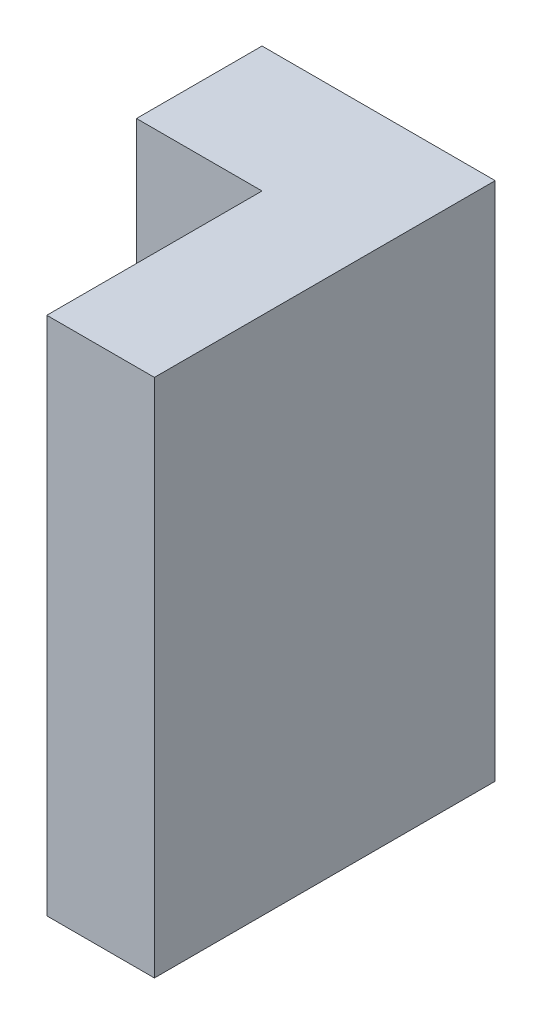
ISO-10303-21;
HEADER;
FILE_DESCRIPTION(('STEP AP214'),'2;1');
FILE_NAME('part.step','',(''),(''),'','','');
FILE_SCHEMA(('AUTOMOTIVE_DESIGN { 1 0 10303 214 1 1 1 1 }'));
ENDSEC;
DATA;
#1=APPLICATION_CONTEXT('core data for automotive mechanical design processes');
#2=APPLICATION_PROTOCOL_DEFINITION('international standard','automotive_design',2000,#1);
#3=PRODUCT_CONTEXT('',#1,'mechanical');
#4=PRODUCT('Part','Part','',(#3));
#5=PRODUCT_RELATED_PRODUCT_CATEGORY('part','',(#4));
#6=PRODUCT_DEFINITION_FORMATION('','',#4);
#7=PRODUCT_DEFINITION_CONTEXT('part definition',#1,'design');
#8=PRODUCT_DEFINITION('design','',#6,#7);
#9=PRODUCT_DEFINITION_SHAPE('','',#8);
#10=(LENGTH_UNIT() NAMED_UNIT(*) SI_UNIT(.MILLI.,.METRE.));
#11=(NAMED_UNIT(*) PLANE_ANGLE_UNIT() SI_UNIT($,.RADIAN.));
#12=(NAMED_UNIT(*) SI_UNIT($,.STERADIAN.) SOLID_ANGLE_UNIT());
#13=UNCERTAINTY_MEASURE_WITH_UNIT(LENGTH_MEASURE(1.E-05),#10,'distance_accuracy_value','');
#14=(GEOMETRIC_REPRESENTATION_CONTEXT(3) GLOBAL_UNCERTAINTY_ASSIGNED_CONTEXT((#13)) GLOBAL_UNIT_ASSIGNED_CONTEXT((#10,
#11,#12)) REPRESENTATION_CONTEXT('',''));
#15=CARTESIAN_POINT('',(0.,0.,0.));
#16=DIRECTION('',(0.,0.,1.));
#17=DIRECTION('',(1.,0.,0.));
#18=AXIS2_PLACEMENT_3D('',#15,#16,#17);
#19=CARTESIAN_POINT('',(0.3,0.,0.35));
#20=DIRECTION('',(0.,0.,1.));
#21=DIRECTION('',(1.,0.,0.));
#22=AXIS2_PLACEMENT_3D('',#19,#20,#21);
#23=PLANE('',#22);
#24=DIRECTION('',(1.,0.,0.));
#25=VECTOR('',#24,1.);
#26=CARTESIAN_POINT('',(0.3,0.,0.35));
#27=LINE('',#26,#25);
#28=CARTESIAN_POINT('',(1.55,0.,0.35));
#29=VERTEX_POINT('',#28);
#30=CARTESIAN_POINT('',(1.900000023842,0.,0.35));
#31=VERTEX_POINT('',#30);
#32=EDGE_CURVE('E67',#29,#31,#27,.T.);
#33=ORIENTED_EDGE('',*,*,#32,.T.);
#34=DIRECTION('',(0.,1.,0.));
#35=VECTOR('',#34,1.);
#36=CARTESIAN_POINT('',(1.900000023842,0.,0.35));
#37=LINE('',#36,#35);
#38=CARTESIAN_POINT('',(1.900000023842,1.450000047684,0.35));
#39=VERTEX_POINT('',#38);
#40=EDGE_CURVE('E84',#31,#39,#37,.T.);
#41=ORIENTED_EDGE('',*,*,#40,.T.);
#42=DIRECTION('',(1.,0.,0.));
#43=VECTOR('',#42,1.);
#44=CARTESIAN_POINT('',(0.3,1.450000047684,0.35));
#45=LINE('',#44,#43);
#46=CARTESIAN_POINT('',(1.55,1.450000047684,0.35));
#47=VERTEX_POINT('',#46);
#48=EDGE_CURVE('E20',#39,#47,#45,.F.);
#49=ORIENTED_EDGE('',*,*,#48,.T.);
#50=DIRECTION('',(0.,1.,0.));
#51=VECTOR('',#50,1.);
#52=CARTESIAN_POINT('',(1.55,0.,0.35));
#53=LINE('',#52,#51);
#54=EDGE_CURVE('E79',#47,#29,#53,.F.);
#55=ORIENTED_EDGE('',*,*,#54,.T.);
#56=EDGE_LOOP('',(#33,#41,#49,#55));
#57=FACE_BOUND('',#56,.T.);
#58=ADVANCED_FACE('F17',(#57),#23,.T.);
#59=CARTESIAN_POINT('',(1.55,0.,0.));
#60=DIRECTION('',(1.,0.,0.));
#61=DIRECTION('',(0.,0.,-1.));
#62=AXIS2_PLACEMENT_3D('',#59,#60,#61);
#63=PLANE('',#62);
#64=DIRECTION('',(0.,0.,1.));
#65=VECTOR('',#64,1.);
#66=CARTESIAN_POINT('',(1.55,0.,0.));
#67=LINE('',#66,#65);
#68=CARTESIAN_POINT('',(1.55,0.,0.));
#69=VERTEX_POINT('',#68);
#70=EDGE_CURVE('E87',#69,#29,#67,.T.);
#71=ORIENTED_EDGE('',*,*,#70,.T.);
#72=ORIENTED_EDGE('',*,*,#54,.F.);
#73=DIRECTION('',(0.,0.,-1.));
#74=VECTOR('',#73,1.);
#75=CARTESIAN_POINT('',(1.55,1.450000047684,0.));
#76=LINE('',#75,#74);
#77=CARTESIAN_POINT('',(1.55,1.450000047684,0.));
#78=VERTEX_POINT('',#77);
#79=EDGE_CURVE('E71',#78,#47,#76,.F.);
#80=ORIENTED_EDGE('',*,*,#79,.F.);
#81=DIRECTION('',(0.,1.,0.));
#82=VECTOR('',#81,1.);
#83=CARTESIAN_POINT('',(1.55,0.,0.));
#84=LINE('',#83,#82);
#85=EDGE_CURVE('E101',#78,#69,#84,.F.);
#86=ORIENTED_EDGE('',*,*,#85,.T.);
#87=EDGE_LOOP('',(#71,#72,#80,#86));
#88=FACE_BOUND('',#87,.T.);
#89=ADVANCED_FACE('F86',(#88),#63,.F.);
#90=CARTESIAN_POINT('',(1.900000023842,0.,0.35));
#91=DIRECTION('',(1.,0.,0.));
#92=DIRECTION('',(0.,0.,-1.));
#93=AXIS2_PLACEMENT_3D('',#90,#91,#92);
#94=PLANE('',#93);
#95=DIRECTION('',(0.,0.,1.));
#96=VECTOR('',#95,1.);
#97=CARTESIAN_POINT('',(1.900000023842,1.450000047684,0.));
#98=LINE('',#97,#96);
#99=CARTESIAN_POINT('',(1.900000023842,1.450000047684,0.95000001490125));
#100=VERTEX_POINT('',#99);
#101=EDGE_CURVE('E96',#39,#100,#98,.T.);
#102=ORIENTED_EDGE('',*,*,#101,.F.);
#103=ORIENTED_EDGE('',*,*,#40,.F.);
#104=DIRECTION('',(0.,0.,1.));
#105=VECTOR('',#104,1.);
#106=CARTESIAN_POINT('',(1.900000023842,0.,0.));
#107=LINE('',#106,#105);
#108=CARTESIAN_POINT('',(1.900000023842,0.,0.95000001490125));
#109=VERTEX_POINT('',#108);
#110=EDGE_CURVE('E94',#31,#109,#107,.T.);
#111=ORIENTED_EDGE('',*,*,#110,.T.);
#112=DIRECTION('',(0.,1.,0.));
#113=VECTOR('',#112,1.);
#114=CARTESIAN_POINT('',(1.900000023842,0.,0.949999988079));
#115=LINE('',#114,#113);
#116=EDGE_CURVE('E110',#100,#109,#115,.F.);
#117=ORIENTED_EDGE('',*,*,#116,.F.);
#118=EDGE_LOOP('',(#102,#103,#111,#117));
#119=FACE_BOUND('',#118,.T.);
#120=ADVANCED_FACE('F92',(#119),#94,.F.);
#121=CARTESIAN_POINT('',(1.55,0.,0.));
#122=DIRECTION('',(0.,1.,0.));
#123=DIRECTION('',(0.,0.,1.));
#124=AXIS2_PLACEMENT_3D('',#121,#122,#123);
#125=PLANE('',#124);
#126=ORIENTED_EDGE('',*,*,#110,.F.);
#127=ORIENTED_EDGE('',*,*,#32,.F.);
#128=ORIENTED_EDGE('',*,*,#70,.F.);
#129=DIRECTION('',(1.,0.,0.));
#130=VECTOR('',#129,1.);
#131=CARTESIAN_POINT('',(1.55,0.,0.));
#132=LINE('',#131,#130);
#133=CARTESIAN_POINT('',(2.199999976158,0.,0.));
#134=VERTEX_POINT('',#133);
#135=EDGE_CURVE('E103',#69,#134,#132,.T.);
#136=ORIENTED_EDGE('',*,*,#135,.T.);
#137=DIRECTION('',(0.,0.,-1.));
#138=VECTOR('',#137,1.);
#139=CARTESIAN_POINT('',(2.199999976158,0.,0.));
#140=LINE('',#139,#138);
#141=CARTESIAN_POINT('',(2.199999976158,0.,0.9500000059605));
#142=VERTEX_POINT('',#141);
#143=EDGE_CURVE('E113',#142,#134,#140,.T.);
#144=ORIENTED_EDGE('',*,*,#143,.F.);
#145=DIRECTION('',(1.,0.,0.));
#146=VECTOR('',#145,1.);
#147=CARTESIAN_POINT('',(1.55,0.,0.949999988079));
#148=LINE('',#147,#146);
#149=EDGE_CURVE('E99',#109,#142,#148,.T.);
#150=ORIENTED_EDGE('',*,*,#149,.F.);
#151=EDGE_LOOP('',(#126,#127,#128,#136,#144,#150));
#152=FACE_BOUND('',#151,.T.);
#153=ADVANCED_FACE('F97',(#152),#125,.F.);
#154=CARTESIAN_POINT('',(1.55,0.,0.));
#155=DIRECTION('',(0.,0.,1.));
#156=DIRECTION('',(1.,0.,0.));
#157=AXIS2_PLACEMENT_3D('',#154,#155,#156);
#158=PLANE('',#157);
#159=DIRECTION('',(0.,1.,0.));
#160=VECTOR('',#159,1.);
#161=CARTESIAN_POINT('',(2.199999976158,0.,0.));
#162=LINE('',#161,#160);
#163=CARTESIAN_POINT('',(2.199999976158,1.450000047684,0.));
#164=VERTEX_POINT('',#163);
#165=EDGE_CURVE('E116',#134,#164,#162,.T.);
#166=ORIENTED_EDGE('',*,*,#165,.F.);
#167=ORIENTED_EDGE('',*,*,#135,.F.);
#168=ORIENTED_EDGE('',*,*,#85,.F.);
#169=DIRECTION('',(1.,0.,0.));
#170=VECTOR('',#169,1.);
#171=CARTESIAN_POINT('',(1.55,1.450000047684,0.));
#172=LINE('',#171,#170);
#173=EDGE_CURVE('E75',#164,#78,#172,.F.);
#174=ORIENTED_EDGE('',*,*,#173,.F.);
#175=EDGE_LOOP('',(#166,#167,#168,#174));
#176=FACE_BOUND('',#175,.T.);
#177=ADVANCED_FACE('F125',(#176),#158,.F.);
#178=CARTESIAN_POINT('',(1.55,1.450000047684,0.));
#179=DIRECTION('',(0.,1.,0.));
#180=DIRECTION('',(0.,0.,1.));
#181=AXIS2_PLACEMENT_3D('',#178,#179,#180);
#182=PLANE('',#181);
#183=ORIENTED_EDGE('',*,*,#101,.T.);
#184=DIRECTION('',(1.,0.,0.));
#185=VECTOR('',#184,1.);
#186=CARTESIAN_POINT('',(1.55,1.450000047684,0.949999988079));
#187=LINE('',#186,#185);
#188=CARTESIAN_POINT('',(2.199999976158,1.450000047684,0.9500000059605));
#189=VERTEX_POINT('',#188);
#190=EDGE_CURVE('E35',#189,#100,#187,.F.);
#191=ORIENTED_EDGE('',*,*,#190,.F.);
#192=DIRECTION('',(0.,0.,-1.));
#193=VECTOR('',#192,1.);
#194=CARTESIAN_POINT('',(2.199999976158,1.450000047684,0.));
#195=LINE('',#194,#193);
#196=EDGE_CURVE('E26',#164,#189,#195,.F.);
#197=ORIENTED_EDGE('',*,*,#196,.F.);
#198=ORIENTED_EDGE('',*,*,#173,.T.);
#199=ORIENTED_EDGE('',*,*,#79,.T.);
#200=ORIENTED_EDGE('',*,*,#48,.F.);
#201=EDGE_LOOP('',(#183,#191,#197,#198,#199,#200));
#202=FACE_BOUND('',#201,.T.);
#203=ADVANCED_FACE('F73',(#202),#182,.T.);
#204=CARTESIAN_POINT('',(1.55,0.,0.949999988079));
#205=DIRECTION('',(0.,0.,1.));
#206=DIRECTION('',(1.,0.,0.));
#207=AXIS2_PLACEMENT_3D('',#204,#205,#206);
#208=PLANE('',#207);
#209=ORIENTED_EDGE('',*,*,#149,.T.);
#210=DIRECTION('',(0.,1.,0.));
#211=VECTOR('',#210,1.);
#212=CARTESIAN_POINT('',(2.199999976158,0.,0.949999988079));
#213=LINE('',#212,#211);
#214=EDGE_CURVE('E11',#189,#142,#213,.F.);
#215=ORIENTED_EDGE('',*,*,#214,.F.);
#216=ORIENTED_EDGE('',*,*,#190,.T.);
#217=ORIENTED_EDGE('',*,*,#116,.T.);
#218=EDGE_LOOP('',(#209,#215,#216,#217));
#219=FACE_BOUND('',#218,.T.);
#220=ADVANCED_FACE('F127',(#219),#208,.T.);
#221=CARTESIAN_POINT('',(2.199999976158,0.,0.));
#222=DIRECTION('',(1.,0.,0.));
#223=DIRECTION('',(0.,0.,-1.));
#224=AXIS2_PLACEMENT_3D('',#221,#222,#223);
#225=PLANE('',#224);
#226=ORIENTED_EDGE('',*,*,#196,.T.);
#227=ORIENTED_EDGE('',*,*,#214,.T.);
#228=ORIENTED_EDGE('',*,*,#143,.T.);
#229=ORIENTED_EDGE('',*,*,#165,.T.);
#230=EDGE_LOOP('',(#226,#227,#228,#229));
#231=FACE_BOUND('',#230,.T.);
#232=ADVANCED_FACE('F121',(#231),#225,.T.);
#233=CLOSED_SHELL('',(#58,#89,#120,#153,#177,#203,#220,#232));
#234=MANIFOLD_SOLID_BREP('B1',#233);
#235=ADVANCED_BREP_SHAPE_REPRESENTATION('',(#18,#234),#14);
#236=SHAPE_DEFINITION_REPRESENTATION(#9,#235);
ENDSEC;
END-ISO-10303-21;
